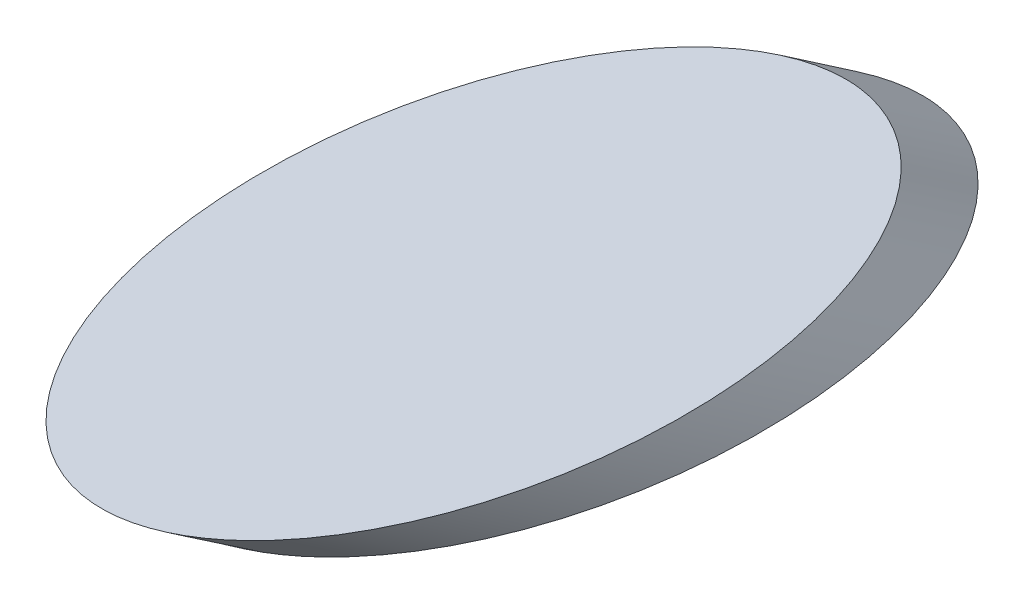
ISO-10303-21;
HEADER;
FILE_DESCRIPTION(('STEP AP214'),'2;1');
FILE_NAME('part.step','',(''),(''),'','','');
FILE_SCHEMA(('AUTOMOTIVE_DESIGN { 1 0 10303 214 1 1 1 1 }'));
ENDSEC;
DATA;
#1=APPLICATION_CONTEXT('core data for automotive mechanical design processes');
#2=APPLICATION_PROTOCOL_DEFINITION('international standard','automotive_design',2000,#1);
#3=PRODUCT_CONTEXT('',#1,'mechanical');
#4=PRODUCT('Part','Part','',(#3));
#5=PRODUCT_RELATED_PRODUCT_CATEGORY('part','',(#4));
#6=PRODUCT_DEFINITION_FORMATION('','',#4);
#7=PRODUCT_DEFINITION_CONTEXT('part definition',#1,'design');
#8=PRODUCT_DEFINITION('design','',#6,#7);
#9=PRODUCT_DEFINITION_SHAPE('','',#8);
#10=(LENGTH_UNIT() NAMED_UNIT(*) SI_UNIT(.MILLI.,.METRE.));
#11=(NAMED_UNIT(*) PLANE_ANGLE_UNIT() SI_UNIT($,.RADIAN.));
#12=(NAMED_UNIT(*) SI_UNIT($,.STERADIAN.) SOLID_ANGLE_UNIT());
#13=UNCERTAINTY_MEASURE_WITH_UNIT(LENGTH_MEASURE(1.E-05),#10,'distance_accuracy_value','');
#14=(GEOMETRIC_REPRESENTATION_CONTEXT(3) GLOBAL_UNCERTAINTY_ASSIGNED_CONTEXT((#13)) GLOBAL_UNIT_ASSIGNED_CONTEXT((#10,
#11,#12)) REPRESENTATION_CONTEXT('',''));
#15=CARTESIAN_POINT('',(0.,0.,0.));
#16=DIRECTION('',(0.,0.,1.));
#17=DIRECTION('',(1.,0.,0.));
#18=AXIS2_PLACEMENT_3D('',#15,#16,#17);
#19=CARTESIAN_POINT('',(0.,0.,0.));
#20=DIRECTION('',(0.,1.,0.));
#21=DIRECTION('',(0.,0.,1.));
#22=AXIS2_PLACEMENT_3D('',#19,#20,#21);
#23=PLANE('',#22);
#24=CARTESIAN_POINT('',(0.,0.,0.));
#25=DIRECTION('',(0.,1.,0.));
#26=DIRECTION('',(0.,0.,-1.));
#27=AXIS2_PLACEMENT_3D('',#24,#25,#26);
#28=ELLIPSE('',#27,14.115,8.);
#29=CARTESIAN_POINT('',(0.,0.,-14.115));
#30=VERTEX_POINT('',#29);
#31=EDGE_CURVE('E42',#30,#30,#28,.T.);
#32=ORIENTED_EDGE('',*,*,#31,.T.);
#33=EDGE_LOOP('',(#32));
#34=FACE_BOUND('',#33,.T.);
#35=ADVANCED_FACE('F35',(#34),#23,.T.);
#36=CARTESIAN_POINT('',(0.,-2.,-2.91728406952659));
#37=DIRECTION('',(0.,1.,0.));
#38=DIRECTION('',(0.,0.,1.));
#39=AXIS2_PLACEMENT_3D('',#36,#37,#38);
#40=PLANE('',#39);
#41=CARTESIAN_POINT('',(0.,-2.,-2.91728406952659));
#42=DIRECTION('',(0.,1.,0.));
#43=DIRECTION('',(0.,0.,-1.));
#44=AXIS2_PLACEMENT_3D('',#41,#42,#43);
#45=ELLIPSE('',#44,14.115,8.);
#46=CARTESIAN_POINT('',(0.,-2.,-17.0322840695266));
#47=VERTEX_POINT('',#46);
#48=EDGE_CURVE('E11',#47,#47,#45,.T.);
#49=ORIENTED_EDGE('',*,*,#48,.F.);
#50=EDGE_LOOP('',(#49));
#51=FACE_BOUND('',#50,.T.);
#52=ADVANCED_FACE('F51',(#51),#40,.F.);
#53=CARTESIAN_POINT('',(0.,0.,-14.115));
#54=CARTESIAN_POINT('',(0.,-2.,-17.0322840695266));
#55=CARTESIAN_POINT('',(-16.,0.,-14.115));
#56=CARTESIAN_POINT('',(-16.,-2.,-17.0322840695266));
#57=CARTESIAN_POINT('',(-16.,0.,14.115));
#58=CARTESIAN_POINT('',(-16.,-2.,11.1977159304734));
#59=CARTESIAN_POINT('',(0.,0.,14.115));
#60=CARTESIAN_POINT('',(0.,-2.,11.1977159304734));
#61=CARTESIAN_POINT('',(16.,0.,14.115));
#62=CARTESIAN_POINT('',(16.,-2.,11.1977159304734));
#63=CARTESIAN_POINT('',(16.,0.,-14.115));
#64=CARTESIAN_POINT('',(16.,-2.,-17.0322840695266));
#65=CARTESIAN_POINT('',(0.,0.,-14.115));
#66=CARTESIAN_POINT('',(0.,-2.,-17.0322840695266));
#67=(BOUNDED_SURFACE() B_SPLINE_SURFACE(3,1,((#53,#54),(#55,#56),(#57,#58),(#59,#60),(#61,#62),
(#63,#64),(#65,#66)),.UNSPECIFIED.,.T.,.F.,.F.) B_SPLINE_SURFACE_WITH_KNOTS((4,3,4),(2,2),(0.,
0.5,1.),(0.,1.),.UNSPECIFIED.) GEOMETRIC_REPRESENTATION_ITEM() RATIONAL_B_SPLINE_SURFACE(((1.,
1.),(0.333333333333333,0.333333333333333),(0.333333333333333,0.333333333333333),(1.,1.),
(0.333333333333333,0.333333333333333),(0.333333333333333,0.333333333333333),(1.,1.))) REPRESENTATION_ITEM('') SURFACE());
#68=ORIENTED_EDGE('',*,*,#48,.T.);
#69=EDGE_LOOP('',(#68));
#70=FACE_BOUND('',#69,.T.);
#71=ORIENTED_EDGE('',*,*,#31,.F.);
#72=EDGE_LOOP('',(#71));
#73=FACE_BOUND('',#72,.T.);
#74=ADVANCED_FACE('F49',(#70,#73),#67,.F.);
#75=CLOSED_SHELL('',(#35,#52,#74));
#76=MANIFOLD_SOLID_BREP('B2',#75);
#77=ADVANCED_BREP_SHAPE_REPRESENTATION('',(#18,#76),#14);
#78=SHAPE_DEFINITION_REPRESENTATION(#9,#77);
ENDSEC;
END-ISO-10303-21;
